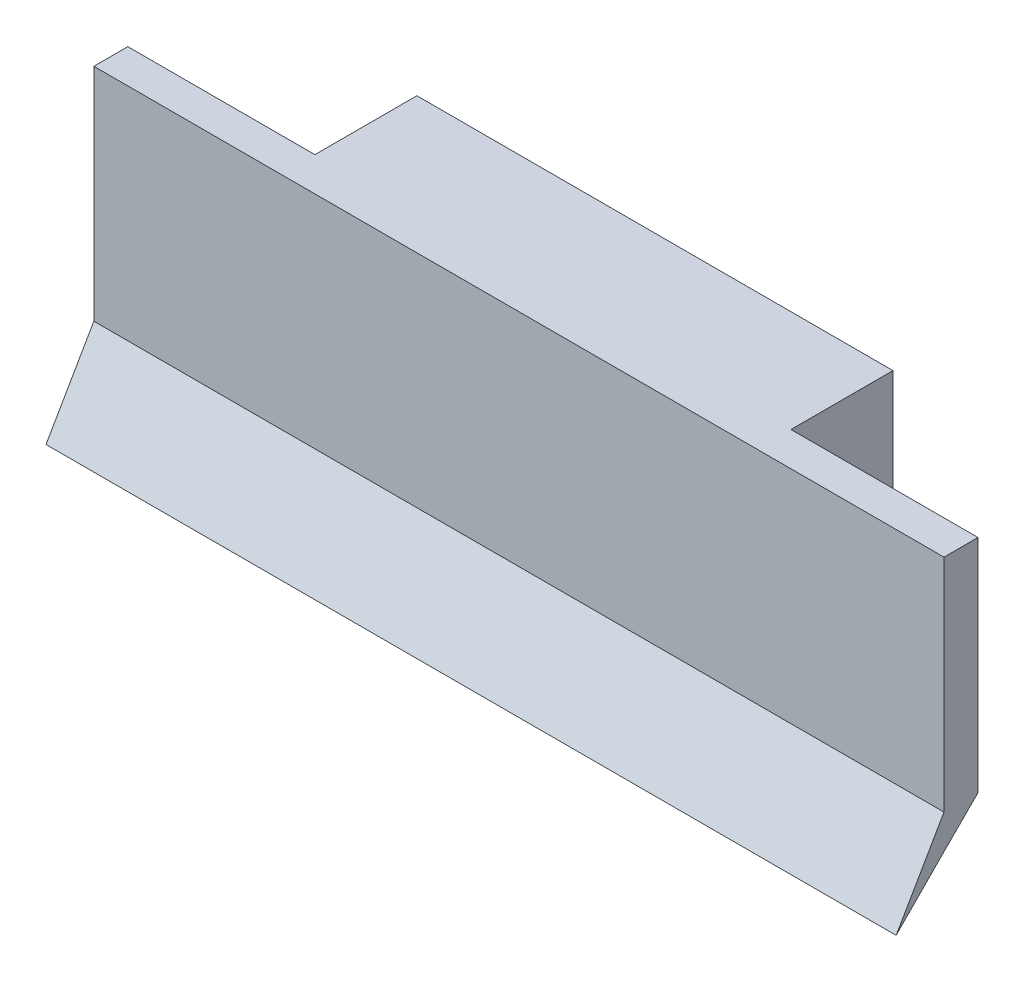
ISO-10303-21;
HEADER;
FILE_DESCRIPTION(('STEP AP214'),'2;1');
FILE_NAME('part.step','',(''),(''),'','','');
FILE_SCHEMA(('AUTOMOTIVE_DESIGN { 1 0 10303 214 1 1 1 1 }'));
ENDSEC;
DATA;
#1=APPLICATION_CONTEXT('core data for automotive mechanical design processes');
#2=APPLICATION_PROTOCOL_DEFINITION('international standard','automotive_design',2000,#1);
#3=PRODUCT_CONTEXT('',#1,'mechanical');
#4=PRODUCT('Part','Part','',(#3));
#5=PRODUCT_RELATED_PRODUCT_CATEGORY('part','',(#4));
#6=PRODUCT_DEFINITION_FORMATION('','',#4);
#7=PRODUCT_DEFINITION_CONTEXT('part definition',#1,'design');
#8=PRODUCT_DEFINITION('design','',#6,#7);
#9=PRODUCT_DEFINITION_SHAPE('','',#8);
#10=(LENGTH_UNIT() NAMED_UNIT(*) SI_UNIT(.MILLI.,.METRE.));
#11=(NAMED_UNIT(*) PLANE_ANGLE_UNIT() SI_UNIT($,.RADIAN.));
#12=(NAMED_UNIT(*) SI_UNIT($,.STERADIAN.) SOLID_ANGLE_UNIT());
#13=UNCERTAINTY_MEASURE_WITH_UNIT(LENGTH_MEASURE(1.E-05),#10,'distance_accuracy_value','');
#14=(GEOMETRIC_REPRESENTATION_CONTEXT(3) GLOBAL_UNCERTAINTY_ASSIGNED_CONTEXT((#13)) GLOBAL_UNIT_ASSIGNED_CONTEXT((#10,
#11,#12)) REPRESENTATION_CONTEXT('',''));
#15=CARTESIAN_POINT('',(0.,0.,0.));
#16=DIRECTION('',(0.,0.,1.));
#17=DIRECTION('',(1.,0.,0.));
#18=AXIS2_PLACEMENT_3D('',#15,#16,#17);
#19=CARTESIAN_POINT('',(50.,-13.4795941948604,28.9222360880015));
#20=DIRECTION('',(0.,0.707106781186546,0.707106781186549));
#21=DIRECTION('',(0.,-0.707106781186549,0.707106781186546));
#22=AXIS2_PLACEMENT_3D('',#19,#20,#21);
#23=PLANE('',#22);
#24=DIRECTION('',(-1.,0.,0.));
#25=VECTOR('',#24,1.);
#26=CARTESIAN_POINT('',(11.,-11.4795941948605,26.9222360880015));
#27=LINE('',#26,#25);
#28=CARTESIAN_POINT('',(11.,-11.4795941948605,26.9222360880015));
#29=VERTEX_POINT('',#28);
#30=CARTESIAN_POINT('',(0.,-11.4795941948604,26.9222360880015));
#31=VERTEX_POINT('',#30);
#32=EDGE_CURVE('E61',#29,#31,#27,.T.);
#33=ORIENTED_EDGE('',*,*,#32,.F.);
#34=DIRECTION('',(0.,0.707106781186552,-0.707106781186543));
#35=VECTOR('',#34,1.);
#36=CARTESIAN_POINT('',(11.,-11.4795941948605,26.9222360880015));
#37=LINE('',#36,#35);
#38=CARTESIAN_POINT('',(11.,-5.47959419486042,20.9222360880015));
#39=VERTEX_POINT('',#38);
#40=EDGE_CURVE('E177',#29,#39,#37,.T.);
#41=ORIENTED_EDGE('',*,*,#40,.T.);
#42=DIRECTION('',(-1.,0.,0.));
#43=VECTOR('',#42,1.);
#44=CARTESIAN_POINT('',(50.,-5.47959419486042,20.9222360880015));
#45=LINE('',#44,#43);
#46=CARTESIAN_POINT('',(39.,-5.47959419486042,20.9222360880015));
#47=VERTEX_POINT('',#46);
#48=EDGE_CURVE('E11',#47,#39,#45,.T.);
#49=ORIENTED_EDGE('',*,*,#48,.F.);
#50=DIRECTION('',(0.,0.707106781186552,-0.707106781186543));
#51=VECTOR('',#50,1.);
#52=CARTESIAN_POINT('',(39.,-11.4795941948605,26.9222360880015));
#53=LINE('',#52,#51);
#54=CARTESIAN_POINT('',(39.,-11.4795941948605,26.9222360880015));
#55=VERTEX_POINT('',#54);
#56=EDGE_CURVE('E198',#55,#47,#53,.T.);
#57=ORIENTED_EDGE('',*,*,#56,.F.);
#58=DIRECTION('',(1.,0.,0.));
#59=VECTOR('',#58,1.);
#60=CARTESIAN_POINT('',(39.,-11.4795941948605,26.9222360880015));
#61=LINE('',#60,#59);
#62=CARTESIAN_POINT('',(50.,-11.4795941948605,26.9222360880015));
#63=VERTEX_POINT('',#62);
#64=EDGE_CURVE('E202',#55,#63,#61,.T.);
#65=ORIENTED_EDGE('',*,*,#64,.T.);
#66=DIRECTION('',(0.,0.707106781186549,-0.707106781186546));
#67=VECTOR('',#66,1.);
#68=CARTESIAN_POINT('',(50.,-13.4795941948604,28.9222360880015));
#69=LINE('',#68,#67);
#70=CARTESIAN_POINT('',(50.,-13.4795941948604,28.9222360880015));
#71=VERTEX_POINT('',#70);
#72=EDGE_CURVE('E136',#71,#63,#69,.T.);
#73=ORIENTED_EDGE('',*,*,#72,.F.);
#74=DIRECTION('',(-1.,0.,0.));
#75=VECTOR('',#74,1.);
#76=CARTESIAN_POINT('',(50.,-13.4795941948604,28.9222360880015));
#77=LINE('',#76,#75);
#78=CARTESIAN_POINT('',(0.,-13.4795941948604,28.9222360880015));
#79=VERTEX_POINT('',#78);
#80=EDGE_CURVE('E153',#71,#79,#77,.T.);
#81=ORIENTED_EDGE('',*,*,#80,.T.);
#82=DIRECTION('',(0.,0.707106781186549,-0.707106781186546));
#83=VECTOR('',#82,1.);
#84=CARTESIAN_POINT('',(0.,-13.4795941948604,28.9222360880015));
#85=LINE('',#84,#83);
#86=EDGE_CURVE('E142',#79,#31,#85,.T.);
#87=ORIENTED_EDGE('',*,*,#86,.T.);
#88=EDGE_LOOP('',(#33,#41,#49,#57,#65,#73,#81,#87));
#89=FACE_BOUND('',#88,.T.);
#90=ADVANCED_FACE('F37',(#89),#23,.F.);
#91=CARTESIAN_POINT('',(50.,1.52040580513958,28.9222360880015));
#92=DIRECTION('',(0.,-1.,0.));
#93=DIRECTION('',(0.,0.,-1.));
#94=AXIS2_PLACEMENT_3D('',#91,#92,#93);
#95=PLANE('',#94);
#96=DIRECTION('',(-1.,0.,0.));
#97=VECTOR('',#96,1.);
#98=CARTESIAN_POINT('',(11.,1.52040580513958,26.9222360880015));
#99=LINE('',#98,#97);
#100=CARTESIAN_POINT('',(11.,1.52040580513958,26.9222360880015));
#101=VERTEX_POINT('',#100);
#102=CARTESIAN_POINT('',(0.,1.52040580513958,26.9222360880015));
#103=VERTEX_POINT('',#102);
#104=EDGE_CURVE('E189',#101,#103,#99,.T.);
#105=ORIENTED_EDGE('',*,*,#104,.T.);
#106=DIRECTION('',(0.,0.,1.));
#107=VECTOR('',#106,1.);
#108=CARTESIAN_POINT('',(0.,1.52040580513958,28.9222360880015));
#109=LINE('',#108,#107);
#110=CARTESIAN_POINT('',(0.,1.52040580513958,28.9222360880015));
#111=VERTEX_POINT('',#110);
#112=EDGE_CURVE('E137',#103,#111,#109,.T.);
#113=ORIENTED_EDGE('',*,*,#112,.T.);
#114=DIRECTION('',(-1.,0.,0.));
#115=VECTOR('',#114,1.);
#116=CARTESIAN_POINT('',(50.,1.52040580513958,28.9222360880015));
#117=LINE('',#116,#115);
#118=CARTESIAN_POINT('',(50.,1.52040580513958,28.9222360880015));
#119=VERTEX_POINT('',#118);
#120=EDGE_CURVE('E135',#119,#111,#117,.T.);
#121=ORIENTED_EDGE('',*,*,#120,.F.);
#122=DIRECTION('',(0.,0.,1.));
#123=VECTOR('',#122,1.);
#124=CARTESIAN_POINT('',(50.,1.52040580513958,28.9222360880015));
#125=LINE('',#124,#123);
#126=CARTESIAN_POINT('',(50.,1.52040580513958,26.9222360880015));
#127=VERTEX_POINT('',#126);
#128=EDGE_CURVE('E140',#127,#119,#125,.T.);
#129=ORIENTED_EDGE('',*,*,#128,.F.);
#130=DIRECTION('',(1.,0.,0.));
#131=VECTOR('',#130,1.);
#132=CARTESIAN_POINT('',(39.,1.52040580513958,26.9222360880015));
#133=LINE('',#132,#131);
#134=CARTESIAN_POINT('',(39.,1.52040580513958,26.9222360880015));
#135=VERTEX_POINT('',#134);
#136=EDGE_CURVE('E200',#135,#127,#133,.T.);
#137=ORIENTED_EDGE('',*,*,#136,.F.);
#138=DIRECTION('',(0.,0.,1.));
#139=VECTOR('',#138,1.);
#140=CARTESIAN_POINT('',(39.,1.52040580513958,20.9222360880015));
#141=LINE('',#140,#139);
#142=CARTESIAN_POINT('',(39.,1.52040580513958,20.9222360880015));
#143=VERTEX_POINT('',#142);
#144=EDGE_CURVE('E166',#143,#135,#141,.T.);
#145=ORIENTED_EDGE('',*,*,#144,.F.);
#146=DIRECTION('',(-1.,0.,0.));
#147=VECTOR('',#146,1.);
#148=CARTESIAN_POINT('',(50.,1.52040580513958,20.9222360880015));
#149=LINE('',#148,#147);
#150=CARTESIAN_POINT('',(11.,1.52040580513958,20.9222360880015));
#151=VERTEX_POINT('',#150);
#152=EDGE_CURVE('E45',#143,#151,#149,.T.);
#153=ORIENTED_EDGE('',*,*,#152,.T.);
#154=DIRECTION('',(0.,0.,1.));
#155=VECTOR('',#154,1.);
#156=CARTESIAN_POINT('',(11.,1.52040580513958,20.9222360880015));
#157=LINE('',#156,#155);
#158=EDGE_CURVE('E163',#151,#101,#157,.T.);
#159=ORIENTED_EDGE('',*,*,#158,.T.);
#160=EDGE_LOOP('',(#105,#113,#121,#129,#137,#145,#153,#159));
#161=FACE_BOUND('',#160,.T.);
#162=ADVANCED_FACE('F162',(#161),#95,.F.);
#163=CARTESIAN_POINT('',(0.,0.,0.));
#164=DIRECTION('',(-1.,0.,0.));
#165=DIRECTION('',(0.,0.,1.));
#166=AXIS2_PLACEMENT_3D('',#163,#164,#165);
#167=PLANE('',#166);
#168=ORIENTED_EDGE('',*,*,#112,.F.);
#169=DIRECTION('',(0.,-1.,0.));
#170=VECTOR('',#169,1.);
#171=CARTESIAN_POINT('',(0.,1.52040580513958,26.9222360880015));
#172=LINE('',#171,#170);
#173=EDGE_CURVE('E178',#103,#31,#172,.T.);
#174=ORIENTED_EDGE('',*,*,#173,.T.);
#175=ORIENTED_EDGE('',*,*,#86,.F.);
#176=DIRECTION('',(0.,0.712589749584181,-0.701580963814979));
#177=VECTOR('',#176,1.);
#178=CARTESIAN_POINT('',(0.,-13.4795941948604,28.9222360880015));
#179=LINE('',#178,#177);
#180=CARTESIAN_POINT('',(0.,-16.3371291991885,31.7356250872699));
#181=VERTEX_POINT('',#180);
#182=EDGE_CURVE('E123',#181,#79,#179,.T.);
#183=ORIENTED_EDGE('',*,*,#182,.F.);
#184=DIRECTION('',(0.,-0.866025403784438,0.5));
#185=VECTOR('',#184,1.);
#186=CARTESIAN_POINT('',(0.,-16.3371291991885,31.7356250872699));
#187=LINE('',#186,#185);
#188=CARTESIAN_POINT('',(0.,-11.4641965110004,28.9222360880015));
#189=VERTEX_POINT('',#188);
#190=EDGE_CURVE('E116',#189,#181,#187,.T.);
#191=ORIENTED_EDGE('',*,*,#190,.F.);
#192=DIRECTION('',(0.,-1.,0.));
#193=VECTOR('',#192,1.);
#194=CARTESIAN_POINT('',(0.,-13.4795941948604,28.9222360880015));
#195=LINE('',#194,#193);
#196=EDGE_CURVE('E129',#111,#189,#195,.T.);
#197=ORIENTED_EDGE('',*,*,#196,.F.);
#198=EDGE_LOOP('',(#168,#174,#175,#183,#191,#197));
#199=FACE_BOUND('',#198,.T.);
#200=ADVANCED_FACE('F128',(#199),#167,.T.);
#201=CARTESIAN_POINT('',(50.,1.52040580513958,20.9222360880015));
#202=DIRECTION('',(0.,0.,1.));
#203=DIRECTION('',(0.,-1.,0.));
#204=AXIS2_PLACEMENT_3D('',#201,#202,#203);
#205=PLANE('',#204);
#206=ORIENTED_EDGE('',*,*,#48,.T.);
#207=DIRECTION('',(0.,1.,0.));
#208=VECTOR('',#207,1.);
#209=CARTESIAN_POINT('',(11.,1.52040580513958,20.9222360880015));
#210=LINE('',#209,#208);
#211=EDGE_CURVE('E173',#39,#151,#210,.T.);
#212=ORIENTED_EDGE('',*,*,#211,.T.);
#213=ORIENTED_EDGE('',*,*,#152,.F.);
#214=DIRECTION('',(0.,1.,0.));
#215=VECTOR('',#214,1.);
#216=CARTESIAN_POINT('',(39.,1.52040580513958,20.9222360880015));
#217=LINE('',#216,#215);
#218=EDGE_CURVE('E171',#47,#143,#217,.T.);
#219=ORIENTED_EDGE('',*,*,#218,.F.);
#220=EDGE_LOOP('',(#206,#212,#213,#219));
#221=FACE_BOUND('',#220,.T.);
#222=ADVANCED_FACE('F170',(#221),#205,.F.);
#223=CARTESIAN_POINT('',(50.,-13.4795941948604,28.9222360880015));
#224=DIRECTION('',(0.,0.,-1.));
#225=DIRECTION('',(0.,1.,0.));
#226=AXIS2_PLACEMENT_3D('',#223,#224,#225);
#227=PLANE('',#226);
#228=ORIENTED_EDGE('',*,*,#196,.T.);
#229=DIRECTION('',(1.,0.,0.));
#230=VECTOR('',#229,1.);
#231=CARTESIAN_POINT('',(0.,-11.4641965110004,28.9222360880015));
#232=LINE('',#231,#230);
#233=CARTESIAN_POINT('',(50.,-11.4641965110004,28.9222360880015));
#234=VERTEX_POINT('',#233);
#235=EDGE_CURVE('E113',#189,#234,#232,.T.);
#236=ORIENTED_EDGE('',*,*,#235,.T.);
#237=DIRECTION('',(0.,-1.,0.));
#238=VECTOR('',#237,1.);
#239=CARTESIAN_POINT('',(50.,-13.4795941948604,28.9222360880015));
#240=LINE('',#239,#238);
#241=EDGE_CURVE('E147',#119,#234,#240,.T.);
#242=ORIENTED_EDGE('',*,*,#241,.F.);
#243=ORIENTED_EDGE('',*,*,#120,.T.);
#244=EDGE_LOOP('',(#228,#236,#242,#243));
#245=FACE_BOUND('',#244,.T.);
#246=ADVANCED_FACE('F133',(#245),#227,.F.);
#247=CARTESIAN_POINT('',(50.,0.,0.));
#248=DIRECTION('',(-1.,0.,0.));
#249=DIRECTION('',(0.,0.,1.));
#250=AXIS2_PLACEMENT_3D('',#247,#248,#249);
#251=PLANE('',#250);
#252=ORIENTED_EDGE('',*,*,#72,.T.);
#253=DIRECTION('',(0.,-1.,0.));
#254=VECTOR('',#253,1.);
#255=CARTESIAN_POINT('',(50.,1.52040580513958,26.9222360880015));
#256=LINE('',#255,#254);
#257=EDGE_CURVE('E191',#127,#63,#256,.T.);
#258=ORIENTED_EDGE('',*,*,#257,.F.);
#259=ORIENTED_EDGE('',*,*,#128,.T.);
#260=ORIENTED_EDGE('',*,*,#241,.T.);
#261=DIRECTION('',(0.,-0.866025403784438,0.5));
#262=VECTOR('',#261,1.);
#263=CARTESIAN_POINT('',(50.,-16.3371291991885,31.7356250872699));
#264=LINE('',#263,#262);
#265=CARTESIAN_POINT('',(50.,-16.3371291991885,31.7356250872699));
#266=VERTEX_POINT('',#265);
#267=EDGE_CURVE('E53',#234,#266,#264,.T.);
#268=ORIENTED_EDGE('',*,*,#267,.T.);
#269=DIRECTION('',(0.,0.712589749584181,-0.701580963814979));
#270=VECTOR('',#269,1.);
#271=CARTESIAN_POINT('',(50.,-13.4795941948604,28.9222360880015));
#272=LINE('',#271,#270);
#273=EDGE_CURVE('E131',#266,#71,#272,.T.);
#274=ORIENTED_EDGE('',*,*,#273,.T.);
#275=EDGE_LOOP('',(#252,#258,#259,#260,#268,#274));
#276=FACE_BOUND('',#275,.T.);
#277=ADVANCED_FACE('F214',(#276),#251,.F.);
#278=CARTESIAN_POINT('',(39.,1.52040580513958,26.9222360880015));
#279=DIRECTION('',(0.,0.,1.));
#280=DIRECTION('',(0.,-1.,0.));
#281=AXIS2_PLACEMENT_3D('',#278,#279,#280);
#282=PLANE('',#281);
#283=ORIENTED_EDGE('',*,*,#257,.T.);
#284=ORIENTED_EDGE('',*,*,#64,.F.);
#285=DIRECTION('',(0.,-1.,0.));
#286=VECTOR('',#285,1.);
#287=CARTESIAN_POINT('',(39.,1.52040580513958,26.9222360880015));
#288=LINE('',#287,#286);
#289=EDGE_CURVE('E195',#135,#55,#288,.T.);
#290=ORIENTED_EDGE('',*,*,#289,.F.);
#291=ORIENTED_EDGE('',*,*,#136,.T.);
#292=EDGE_LOOP('',(#283,#284,#290,#291));
#293=FACE_BOUND('',#292,.T.);
#294=ADVANCED_FACE('F219',(#293),#282,.F.);
#295=CARTESIAN_POINT('',(39.,0.,0.));
#296=DIRECTION('',(-1.,0.,0.));
#297=DIRECTION('',(0.,0.,1.));
#298=AXIS2_PLACEMENT_3D('',#295,#296,#297);
#299=PLANE('',#298);
#300=ORIENTED_EDGE('',*,*,#218,.T.);
#301=ORIENTED_EDGE('',*,*,#144,.T.);
#302=ORIENTED_EDGE('',*,*,#289,.T.);
#303=ORIENTED_EDGE('',*,*,#56,.T.);
#304=EDGE_LOOP('',(#300,#301,#302,#303));
#305=FACE_BOUND('',#304,.T.);
#306=ADVANCED_FACE('F222',(#305),#299,.F.);
#307=CARTESIAN_POINT('',(11.,1.52040580513958,26.9222360880015));
#308=DIRECTION('',(0.,0.,-1.));
#309=DIRECTION('',(0.,1.,0.));
#310=AXIS2_PLACEMENT_3D('',#307,#308,#309);
#311=PLANE('',#310);
#312=ORIENTED_EDGE('',*,*,#173,.F.);
#313=ORIENTED_EDGE('',*,*,#104,.F.);
#314=DIRECTION('',(0.,-1.,0.));
#315=VECTOR('',#314,1.);
#316=CARTESIAN_POINT('',(11.,1.52040580513958,26.9222360880015));
#317=LINE('',#316,#315);
#318=EDGE_CURVE('E180',#101,#29,#317,.T.);
#319=ORIENTED_EDGE('',*,*,#318,.T.);
#320=ORIENTED_EDGE('',*,*,#32,.T.);
#321=EDGE_LOOP('',(#312,#313,#319,#320));
#322=FACE_BOUND('',#321,.T.);
#323=ADVANCED_FACE('F210',(#322),#311,.T.);
#324=CARTESIAN_POINT('',(11.,0.,0.));
#325=DIRECTION('',(1.,0.,0.));
#326=DIRECTION('',(0.,0.,1.));
#327=AXIS2_PLACEMENT_3D('',#324,#325,#326);
#328=PLANE('',#327);
#329=ORIENTED_EDGE('',*,*,#211,.F.);
#330=ORIENTED_EDGE('',*,*,#40,.F.);
#331=ORIENTED_EDGE('',*,*,#318,.F.);
#332=ORIENTED_EDGE('',*,*,#158,.F.);
#333=EDGE_LOOP('',(#329,#330,#331,#332));
#334=FACE_BOUND('',#333,.T.);
#335=ADVANCED_FACE('F229',(#334),#328,.F.);
#336=CARTESIAN_POINT('',(0.,-13.4795941948604,28.9222360880015));
#337=DIRECTION('',(0.,-0.701580963814979,-0.712589749584181));
#338=DIRECTION('',(0.,0.712589749584181,-0.701580963814979));
#339=AXIS2_PLACEMENT_3D('',#336,#337,#338);
#340=PLANE('',#339);
#341=ORIENTED_EDGE('',*,*,#273,.F.);
#342=DIRECTION('',(1.,0.,0.));
#343=VECTOR('',#342,1.);
#344=CARTESIAN_POINT('',(0.,-16.3371291991885,31.7356250872699));
#345=LINE('',#344,#343);
#346=EDGE_CURVE('E122',#181,#266,#345,.T.);
#347=ORIENTED_EDGE('',*,*,#346,.F.);
#348=ORIENTED_EDGE('',*,*,#182,.T.);
#349=ORIENTED_EDGE('',*,*,#80,.F.);
#350=EDGE_LOOP('',(#341,#347,#348,#349));
#351=FACE_BOUND('',#350,.T.);
#352=ADVANCED_FACE('F287',(#351),#340,.T.);
#353=CARTESIAN_POINT('',(0.,-16.3371291991885,31.7356250872699));
#354=DIRECTION('',(0.,0.5,0.866025403784438));
#355=DIRECTION('',(0.,-0.866025403784438,0.5));
#356=AXIS2_PLACEMENT_3D('',#353,#354,#355);
#357=PLANE('',#356);
#358=ORIENTED_EDGE('',*,*,#267,.F.);
#359=ORIENTED_EDGE('',*,*,#235,.F.);
#360=ORIENTED_EDGE('',*,*,#190,.T.);
#361=ORIENTED_EDGE('',*,*,#346,.T.);
#362=EDGE_LOOP('',(#358,#359,#360,#361));
#363=FACE_BOUND('',#362,.T.);
#364=ADVANCED_FACE('F115',(#363),#357,.T.);
#365=CLOSED_SHELL('',(#90,#162,#200,#222,#246,#277,#294,#306,#323,#335,#352,#364));
#366=MANIFOLD_SOLID_BREP('B2',#365);
#367=ADVANCED_BREP_SHAPE_REPRESENTATION('',(#18,#366),#14);
#368=SHAPE_DEFINITION_REPRESENTATION(#9,#367);
ENDSEC;
END-ISO-10303-21;
